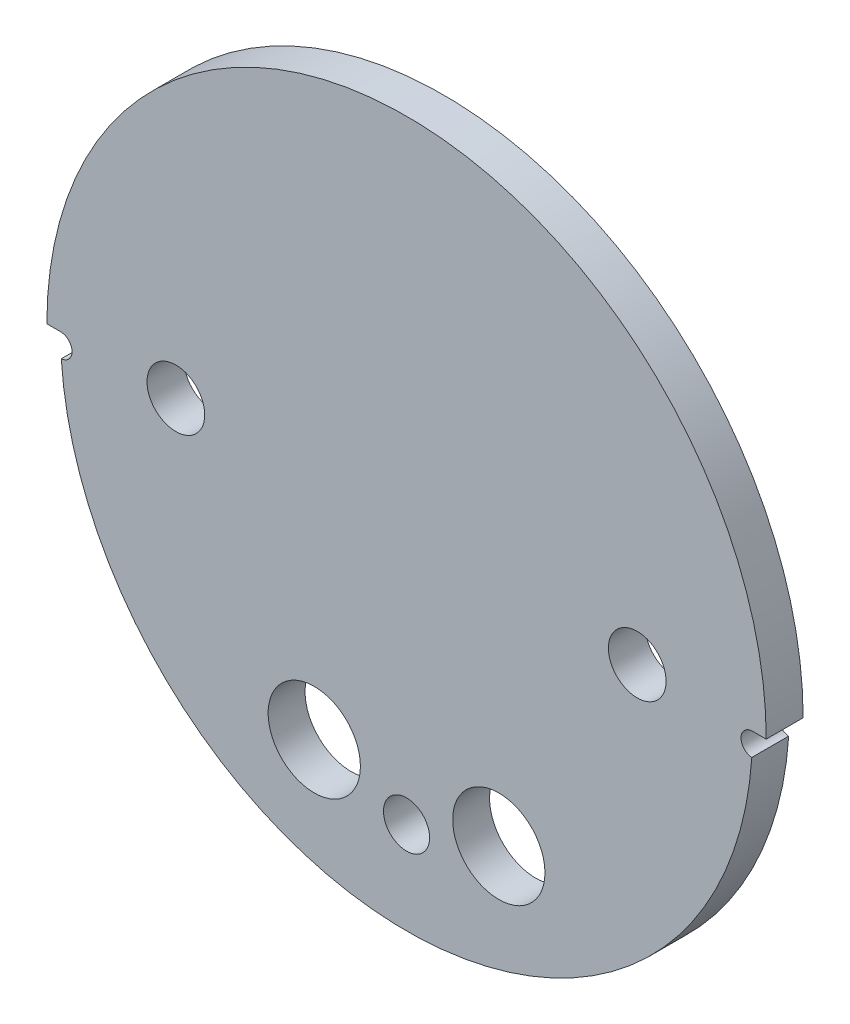
ISO-10303-21;
HEADER;
FILE_DESCRIPTION(('STEP AP214'),'2;1');
FILE_NAME('part.step','',(''),(''),'','','');
FILE_SCHEMA(('AUTOMOTIVE_DESIGN { 1 0 10303 214 1 1 1 1 }'));
ENDSEC;
DATA;
#1=APPLICATION_CONTEXT('core data for automotive mechanical design processes');
#2=APPLICATION_PROTOCOL_DEFINITION('international standard','automotive_design',2000,#1);
#3=PRODUCT_CONTEXT('',#1,'mechanical');
#4=PRODUCT('Part','Part','',(#3));
#5=PRODUCT_RELATED_PRODUCT_CATEGORY('part','',(#4));
#6=PRODUCT_DEFINITION_FORMATION('','',#4);
#7=PRODUCT_DEFINITION_CONTEXT('part definition',#1,'design');
#8=PRODUCT_DEFINITION('design','',#6,#7);
#9=PRODUCT_DEFINITION_SHAPE('','',#8);
#10=(LENGTH_UNIT() NAMED_UNIT(*) SI_UNIT(.MILLI.,.METRE.));
#11=(NAMED_UNIT(*) PLANE_ANGLE_UNIT() SI_UNIT($,.RADIAN.));
#12=(NAMED_UNIT(*) SI_UNIT($,.STERADIAN.) SOLID_ANGLE_UNIT());
#13=UNCERTAINTY_MEASURE_WITH_UNIT(LENGTH_MEASURE(1.E-05),#10,'distance_accuracy_value','');
#14=(GEOMETRIC_REPRESENTATION_CONTEXT(3) GLOBAL_UNCERTAINTY_ASSIGNED_CONTEXT((#13)) GLOBAL_UNIT_ASSIGNED_CONTEXT((#10,
#11,#12)) REPRESENTATION_CONTEXT('',''));
#15=CARTESIAN_POINT('',(0.,0.,0.));
#16=DIRECTION('',(0.,0.,1.));
#17=DIRECTION('',(1.,0.,0.));
#18=AXIS2_PLACEMENT_3D('',#15,#16,#17);
#19=CARTESIAN_POINT('',(0.,0.,8.255));
#20=DIRECTION('',(0.,0.,-1.));
#21=DIRECTION('',(-1.,0.,0.));
#22=AXIS2_PLACEMENT_3D('',#19,#20,#21);
#23=CYLINDRICAL_SURFACE('',#22,47.625);
#24=CARTESIAN_POINT('',(0.,0.,0.));
#25=DIRECTION('',(0.,0.,-1.));
#26=DIRECTION('',(1.,0.,0.));
#27=AXIS2_PLACEMENT_3D('',#24,#25,#26);
#28=CIRCLE('',#27,47.625);
#29=CARTESIAN_POINT('',(47.5192841287458,-3.17147613762486,0.));
#30=VERTEX_POINT('',#29);
#31=CARTESIAN_POINT('',(-47.5192841287458,-3.17147613762486,0.));
#32=VERTEX_POINT('',#31);
#33=EDGE_CURVE('E104',#30,#32,#28,.T.);
#34=ORIENTED_EDGE('',*,*,#33,.F.);
#35=DIRECTION('',(0.,0.,-1.));
#36=VECTOR('',#35,1.);
#37=CARTESIAN_POINT('',(47.5192841287458,-3.17147613762486,2.54));
#38=LINE('',#37,#36);
#39=CARTESIAN_POINT('',(47.5192841287458,-3.17147613762486,5.08));
#40=VERTEX_POINT('',#39);
#41=EDGE_CURVE('E145',#30,#40,#38,.F.);
#42=ORIENTED_EDGE('',*,*,#41,.T.);
#43=CARTESIAN_POINT('',(0.,0.,5.08));
#44=DIRECTION('',(0.,0.,1.));
#45=DIRECTION('',(1.,0.,0.));
#46=AXIS2_PLACEMENT_3D('',#43,#44,#45);
#47=CIRCLE('',#46,47.625);
#48=CARTESIAN_POINT('',(-47.5192841287458,-3.17147613762486,5.08));
#49=VERTEX_POINT('',#48);
#50=EDGE_CURVE('E148',#49,#40,#47,.T.);
#51=ORIENTED_EDGE('',*,*,#50,.F.);
#52=DIRECTION('',(0.,0.,-1.));
#53=VECTOR('',#52,1.);
#54=CARTESIAN_POINT('',(-47.5192841287458,-3.17147613762486,2.54));
#55=LINE('',#54,#53);
#56=EDGE_CURVE('E147',#49,#32,#55,.T.);
#57=ORIENTED_EDGE('',*,*,#56,.T.);
#58=EDGE_LOOP('',(#34,#42,#51,#57));
#59=FACE_BOUND('',#58,.T.);
#60=ADVANCED_FACE('F34',(#59),#23,.T.);
#61=CARTESIAN_POINT('',(31.75,0.,0.));
#62=DIRECTION('',(0.,0.,1.));
#63=DIRECTION('',(1.,0.,0.));
#64=AXIS2_PLACEMENT_3D('',#61,#62,#63);
#65=CYLINDRICAL_SURFACE('',#64,3.96875);
#66=CARTESIAN_POINT('',(31.75,0.,0.));
#67=DIRECTION('',(0.,0.,1.));
#68=DIRECTION('',(1.,0.,0.));
#69=AXIS2_PLACEMENT_3D('',#66,#67,#68);
#70=CIRCLE('',#69,3.96875);
#71=CARTESIAN_POINT('',(35.71875,0.,0.));
#72=VERTEX_POINT('',#71);
#73=EDGE_CURVE('E127',#72,#72,#70,.T.);
#74=ORIENTED_EDGE('',*,*,#73,.F.);
#75=EDGE_LOOP('',(#74));
#76=FACE_BOUND('',#75,.T.);
#77=CARTESIAN_POINT('',(31.75,0.,5.08));
#78=DIRECTION('',(0.,0.,1.));
#79=DIRECTION('',(1.,0.,0.));
#80=AXIS2_PLACEMENT_3D('',#77,#78,#79);
#81=CIRCLE('',#80,3.96875);
#82=CARTESIAN_POINT('',(35.71875,0.,5.08));
#83=VERTEX_POINT('',#82);
#84=EDGE_CURVE('E115',#83,#83,#81,.F.);
#85=ORIENTED_EDGE('',*,*,#84,.F.);
#86=EDGE_LOOP('',(#85));
#87=FACE_BOUND('',#86,.T.);
#88=ADVANCED_FACE('F169',(#76,#87),#65,.F.);
#89=CARTESIAN_POINT('',(-12.7,-31.1667936271924,0.));
#90=DIRECTION('',(0.,0.,1.));
#91=DIRECTION('',(1.,0.,0.));
#92=AXIS2_PLACEMENT_3D('',#89,#90,#91);
#93=CYLINDRICAL_SURFACE('',#92,6.35);
#94=CARTESIAN_POINT('',(-12.7,-31.1667936271924,0.));
#95=DIRECTION('',(0.,0.,1.));
#96=DIRECTION('',(1.,0.,0.));
#97=AXIS2_PLACEMENT_3D('',#94,#95,#96);
#98=CIRCLE('',#97,6.35);
#99=CARTESIAN_POINT('',(-6.34999999999999,-31.1667936271924,0.));
#100=VERTEX_POINT('',#99);
#101=EDGE_CURVE('E130',#100,#100,#98,.T.);
#102=ORIENTED_EDGE('',*,*,#101,.F.);
#103=EDGE_LOOP('',(#102));
#104=FACE_BOUND('',#103,.T.);
#105=CARTESIAN_POINT('',(-12.7,-31.1667936271924,5.08));
#106=DIRECTION('',(0.,0.,1.));
#107=DIRECTION('',(1.,0.,0.));
#108=AXIS2_PLACEMENT_3D('',#105,#106,#107);
#109=CIRCLE('',#108,6.35);
#110=CARTESIAN_POINT('',(-6.34999999999999,-31.1667936271924,5.08));
#111=VERTEX_POINT('',#110);
#112=EDGE_CURVE('E162',#111,#111,#109,.F.);
#113=ORIENTED_EDGE('',*,*,#112,.F.);
#114=EDGE_LOOP('',(#113));
#115=FACE_BOUND('',#114,.T.);
#116=ADVANCED_FACE('F171',(#104,#115),#93,.F.);
#117=CARTESIAN_POINT('',(12.7,-31.1667936271924,0.));
#118=DIRECTION('',(0.,0.,1.));
#119=DIRECTION('',(1.,0.,0.));
#120=AXIS2_PLACEMENT_3D('',#117,#118,#119);
#121=CYLINDRICAL_SURFACE('',#120,6.35);
#122=CARTESIAN_POINT('',(12.7,-31.1667936271924,0.));
#123=DIRECTION('',(0.,0.,1.));
#124=DIRECTION('',(1.,0.,0.));
#125=AXIS2_PLACEMENT_3D('',#122,#123,#124);
#126=CIRCLE('',#125,6.35);
#127=CARTESIAN_POINT('',(19.05,-31.1667936271924,0.));
#128=VERTEX_POINT('',#127);
#129=EDGE_CURVE('E122',#128,#128,#126,.T.);
#130=ORIENTED_EDGE('',*,*,#129,.F.);
#131=EDGE_LOOP('',(#130));
#132=FACE_BOUND('',#131,.T.);
#133=CARTESIAN_POINT('',(12.7,-31.1667936271924,5.08));
#134=DIRECTION('',(0.,0.,1.));
#135=DIRECTION('',(1.,0.,0.));
#136=AXIS2_PLACEMENT_3D('',#133,#134,#135);
#137=CIRCLE('',#136,6.35);
#138=CARTESIAN_POINT('',(19.05,-31.1667936271924,5.08));
#139=VERTEX_POINT('',#138);
#140=EDGE_CURVE('E159',#139,#139,#137,.F.);
#141=ORIENTED_EDGE('',*,*,#140,.F.);
#142=EDGE_LOOP('',(#141));
#143=FACE_BOUND('',#142,.T.);
#144=ADVANCED_FACE('F178',(#132,#143),#121,.F.);
#145=CARTESIAN_POINT('',(-31.75,0.,0.));
#146=DIRECTION('',(0.,0.,1.));
#147=DIRECTION('',(1.,0.,0.));
#148=AXIS2_PLACEMENT_3D('',#145,#146,#147);
#149=CYLINDRICAL_SURFACE('',#148,3.96875);
#150=CARTESIAN_POINT('',(-31.75,0.,0.));
#151=DIRECTION('',(0.,0.,1.));
#152=DIRECTION('',(1.,0.,0.));
#153=AXIS2_PLACEMENT_3D('',#150,#151,#152);
#154=CIRCLE('',#153,3.96875);
#155=CARTESIAN_POINT('',(-27.78125,0.,0.));
#156=VERTEX_POINT('',#155);
#157=EDGE_CURVE('E123',#156,#156,#154,.T.);
#158=ORIENTED_EDGE('',*,*,#157,.F.);
#159=EDGE_LOOP('',(#158));
#160=FACE_BOUND('',#159,.T.);
#161=CARTESIAN_POINT('',(-31.75,0.,5.08));
#162=DIRECTION('',(0.,0.,1.));
#163=DIRECTION('',(1.,0.,0.));
#164=AXIS2_PLACEMENT_3D('',#161,#162,#163);
#165=CIRCLE('',#164,3.96875);
#166=CARTESIAN_POINT('',(-27.78125,0.,5.08));
#167=VERTEX_POINT('',#166);
#168=EDGE_CURVE('E156',#167,#167,#165,.F.);
#169=ORIENTED_EDGE('',*,*,#168,.F.);
#170=EDGE_LOOP('',(#169));
#171=FACE_BOUND('',#170,.T.);
#172=ADVANCED_FACE('F210',(#160,#171),#149,.F.);
#173=CARTESIAN_POINT('',(0.,0.,5.08));
#174=DIRECTION('',(0.,0.,-1.));
#175=DIRECTION('',(-1.,0.,0.));
#176=AXIS2_PLACEMENT_3D('',#173,#174,#175);
#177=CYLINDRICAL_SURFACE('',#176,49.5046);
#178=CARTESIAN_POINT('',(0.,0.,5.08));
#179=DIRECTION('',(0.,0.,1.));
#180=DIRECTION('',(1.,0.,0.));
#181=AXIS2_PLACEMENT_3D('',#178,#179,#180);
#182=CIRCLE('',#181,49.5046);
#183=CARTESIAN_POINT('',(49.5046,0.,5.08));
#184=VERTEX_POINT('',#183);
#185=CARTESIAN_POINT('',(-49.5046,0.,5.08));
#186=VERTEX_POINT('',#185);
#187=EDGE_CURVE('E42',#184,#186,#182,.T.);
#188=ORIENTED_EDGE('',*,*,#187,.F.);
#189=DIRECTION('',(0.,0.,-1.));
#190=VECTOR('',#189,1.);
#191=CARTESIAN_POINT('',(49.5046,0.,5.08));
#192=LINE('',#191,#190);
#193=CARTESIAN_POINT('',(49.5046,0.,0.));
#194=VERTEX_POINT('',#193);
#195=EDGE_CURVE('E120',#184,#194,#192,.T.);
#196=ORIENTED_EDGE('',*,*,#195,.T.);
#197=CARTESIAN_POINT('',(0.,0.,0.));
#198=DIRECTION('',(0.,0.,1.));
#199=DIRECTION('',(1.,0.,0.));
#200=AXIS2_PLACEMENT_3D('',#197,#198,#199);
#201=CIRCLE('',#200,49.5046);
#202=CARTESIAN_POINT('',(-49.5046,0.,0.));
#203=VERTEX_POINT('',#202);
#204=EDGE_CURVE('E126',#194,#203,#201,.T.);
#205=ORIENTED_EDGE('',*,*,#204,.T.);
#206=DIRECTION('',(0.,0.,-1.));
#207=VECTOR('',#206,1.);
#208=CARTESIAN_POINT('',(-49.5046,0.,5.08));
#209=LINE('',#208,#207);
#210=EDGE_CURVE('E55',#203,#186,#209,.F.);
#211=ORIENTED_EDGE('',*,*,#210,.T.);
#212=EDGE_LOOP('',(#188,#196,#205,#211));
#213=FACE_BOUND('',#212,.T.);
#214=ADVANCED_FACE('F36',(#213),#177,.T.);
#215=CARTESIAN_POINT('',(0.,0.,5.08));
#216=DIRECTION('',(0.,0.,1.));
#217=DIRECTION('',(1.,0.,0.));
#218=AXIS2_PLACEMENT_3D('',#215,#216,#217);
#219=PLANE('',#218);
#220=CARTESIAN_POINT('',(0.,-34.925,5.08));
#221=DIRECTION('',(0.,0.,1.));
#222=DIRECTION('',(1.,0.,0.));
#223=AXIS2_PLACEMENT_3D('',#220,#221,#222);
#224=CIRCLE('',#223,3.175);
#225=CARTESIAN_POINT('',(3.175,-34.925,5.08));
#226=VERTEX_POINT('',#225);
#227=EDGE_CURVE('E237',#226,#226,#224,.T.);
#228=ORIENTED_EDGE('',*,*,#227,.F.);
#229=EDGE_LOOP('',(#228));
#230=FACE_BOUND('',#229,.T.);
#231=CARTESIAN_POINT('',(47.625,-1.5875,5.08));
#232=DIRECTION('',(0.,0.,-1.));
#233=DIRECTION('',(-1.,0.,0.));
#234=AXIS2_PLACEMENT_3D('',#231,#232,#233);
#235=CIRCLE('',#234,1.5875);
#236=CARTESIAN_POINT('',(47.625,0.,5.08));
#237=VERTEX_POINT('',#236);
#238=EDGE_CURVE('E140',#40,#237,#235,.T.);
#239=ORIENTED_EDGE('',*,*,#238,.T.);
#240=DIRECTION('',(-1.,0.,0.));
#241=VECTOR('',#240,1.);
#242=CARTESIAN_POINT('',(47.625,0.,5.08));
#243=LINE('',#242,#241);
#244=EDGE_CURVE('E109',#184,#237,#243,.T.);
#245=ORIENTED_EDGE('',*,*,#244,.F.);
#246=ORIENTED_EDGE('',*,*,#187,.T.);
#247=DIRECTION('',(-1.,0.,0.));
#248=VECTOR('',#247,1.);
#249=CARTESIAN_POINT('',(-50.165,0.,5.08));
#250=LINE('',#249,#248);
#251=CARTESIAN_POINT('',(-47.625,0.,5.08));
#252=VERTEX_POINT('',#251);
#253=EDGE_CURVE('E113',#252,#186,#250,.T.);
#254=ORIENTED_EDGE('',*,*,#253,.F.);
#255=CARTESIAN_POINT('',(-47.625,-1.5875,5.08));
#256=DIRECTION('',(0.,0.,-1.));
#257=DIRECTION('',(-1.,0.,0.));
#258=AXIS2_PLACEMENT_3D('',#255,#256,#257);
#259=CIRCLE('',#258,1.5875);
#260=EDGE_CURVE('E92',#252,#49,#259,.T.);
#261=ORIENTED_EDGE('',*,*,#260,.T.);
#262=ORIENTED_EDGE('',*,*,#50,.T.);
#263=EDGE_LOOP('',(#239,#245,#246,#254,#261,#262));
#264=FACE_BOUND('',#263,.T.);
#265=ORIENTED_EDGE('',*,*,#168,.T.);
#266=EDGE_LOOP('',(#265));
#267=FACE_BOUND('',#266,.T.);
#268=ORIENTED_EDGE('',*,*,#140,.T.);
#269=EDGE_LOOP('',(#268));
#270=FACE_BOUND('',#269,.T.);
#271=ORIENTED_EDGE('',*,*,#112,.T.);
#272=EDGE_LOOP('',(#271));
#273=FACE_BOUND('',#272,.T.);
#274=ORIENTED_EDGE('',*,*,#84,.T.);
#275=EDGE_LOOP('',(#274));
#276=FACE_BOUND('',#275,.T.);
#277=ADVANCED_FACE('F167',(#230,#264,#267,#270,#273,#276),#219,.T.);
#278=CARTESIAN_POINT('',(0.,0.,0.));
#279=DIRECTION('',(0.,0.,1.));
#280=DIRECTION('',(1.,0.,0.));
#281=AXIS2_PLACEMENT_3D('',#278,#279,#280);
#282=PLANE('',#281);
#283=CARTESIAN_POINT('',(0.,-34.925,0.));
#284=DIRECTION('',(0.,0.,1.));
#285=DIRECTION('',(1.,0.,0.));
#286=AXIS2_PLACEMENT_3D('',#283,#284,#285);
#287=CIRCLE('',#286,3.175);
#288=CARTESIAN_POINT('',(3.175,-34.925,0.));
#289=VERTEX_POINT('',#288);
#290=EDGE_CURVE('E105',#289,#289,#287,.T.);
#291=ORIENTED_EDGE('',*,*,#290,.T.);
#292=EDGE_LOOP('',(#291));
#293=FACE_BOUND('',#292,.T.);
#294=ORIENTED_EDGE('',*,*,#157,.T.);
#295=EDGE_LOOP('',(#294));
#296=FACE_BOUND('',#295,.T.);
#297=ORIENTED_EDGE('',*,*,#129,.T.);
#298=EDGE_LOOP('',(#297));
#299=FACE_BOUND('',#298,.T.);
#300=ORIENTED_EDGE('',*,*,#101,.T.);
#301=EDGE_LOOP('',(#300));
#302=FACE_BOUND('',#301,.T.);
#303=ORIENTED_EDGE('',*,*,#73,.T.);
#304=EDGE_LOOP('',(#303));
#305=FACE_BOUND('',#304,.T.);
#306=DIRECTION('',(-1.,0.,0.));
#307=VECTOR('',#306,1.);
#308=CARTESIAN_POINT('',(0.,0.,0.));
#309=LINE('',#308,#307);
#310=CARTESIAN_POINT('',(47.625,0.,0.));
#311=VERTEX_POINT('',#310);
#312=EDGE_CURVE('E11',#194,#311,#309,.T.);
#313=ORIENTED_EDGE('',*,*,#312,.T.);
#314=CARTESIAN_POINT('',(47.625,-1.5875,0.));
#315=DIRECTION('',(0.,0.,-1.));
#316=DIRECTION('',(-1.,0.,0.));
#317=AXIS2_PLACEMENT_3D('',#314,#315,#316);
#318=CIRCLE('',#317,1.5875);
#319=EDGE_CURVE('E138',#30,#311,#318,.T.);
#320=ORIENTED_EDGE('',*,*,#319,.F.);
#321=ORIENTED_EDGE('',*,*,#33,.T.);
#322=CARTESIAN_POINT('',(-47.625,-1.5875,0.));
#323=DIRECTION('',(0.,0.,-1.));
#324=DIRECTION('',(-1.,0.,0.));
#325=AXIS2_PLACEMENT_3D('',#322,#323,#324);
#326=CIRCLE('',#325,1.5875);
#327=CARTESIAN_POINT('',(-47.625,0.,0.));
#328=VERTEX_POINT('',#327);
#329=EDGE_CURVE('E89',#328,#32,#326,.T.);
#330=ORIENTED_EDGE('',*,*,#329,.F.);
#331=DIRECTION('',(-1.,0.,0.));
#332=VECTOR('',#331,1.);
#333=CARTESIAN_POINT('',(-50.165,0.,0.));
#334=LINE('',#333,#332);
#335=EDGE_CURVE('E95',#328,#203,#334,.T.);
#336=ORIENTED_EDGE('',*,*,#335,.T.);
#337=ORIENTED_EDGE('',*,*,#204,.F.);
#338=EDGE_LOOP('',(#313,#320,#321,#330,#336,#337));
#339=FACE_BOUND('',#338,.T.);
#340=ADVANCED_FACE('F99',(#293,#296,#299,#302,#305,#339),#282,.F.);
#341=CARTESIAN_POINT('',(47.625,0.,0.));
#342=DIRECTION('',(0.,1.,0.));
#343=DIRECTION('',(0.,0.,1.));
#344=AXIS2_PLACEMENT_3D('',#341,#342,#343);
#345=PLANE('',#344);
#346=ORIENTED_EDGE('',*,*,#244,.T.);
#347=DIRECTION('',(0.,0.,1.));
#348=VECTOR('',#347,1.);
#349=CARTESIAN_POINT('',(47.625,0.,0.));
#350=LINE('',#349,#348);
#351=EDGE_CURVE('E94',#311,#237,#350,.T.);
#352=ORIENTED_EDGE('',*,*,#351,.F.);
#353=ORIENTED_EDGE('',*,*,#312,.F.);
#354=ORIENTED_EDGE('',*,*,#195,.F.);
#355=EDGE_LOOP('',(#346,#352,#353,#354));
#356=FACE_BOUND('',#355,.T.);
#357=ADVANCED_FACE('F189',(#356),#345,.F.);
#358=CARTESIAN_POINT('',(-50.165,0.,0.));
#359=DIRECTION('',(0.,1.,0.));
#360=DIRECTION('',(0.,0.,1.));
#361=AXIS2_PLACEMENT_3D('',#358,#359,#360);
#362=PLANE('',#361);
#363=ORIENTED_EDGE('',*,*,#335,.F.);
#364=DIRECTION('',(0.,0.,1.));
#365=VECTOR('',#364,1.);
#366=CARTESIAN_POINT('',(-47.625,0.,0.));
#367=LINE('',#366,#365);
#368=EDGE_CURVE('E86',#328,#252,#367,.T.);
#369=ORIENTED_EDGE('',*,*,#368,.T.);
#370=ORIENTED_EDGE('',*,*,#253,.T.);
#371=ORIENTED_EDGE('',*,*,#210,.F.);
#372=EDGE_LOOP('',(#363,#369,#370,#371));
#373=FACE_BOUND('',#372,.T.);
#374=ADVANCED_FACE('F107',(#373),#362,.F.);
#375=CARTESIAN_POINT('',(-47.625,-1.5875,5.08));
#376=DIRECTION('',(0.,0.,-1.));
#377=DIRECTION('',(-1.,0.,0.));
#378=AXIS2_PLACEMENT_3D('',#375,#376,#377);
#379=CYLINDRICAL_SURFACE('',#378,1.5875);
#380=ORIENTED_EDGE('',*,*,#260,.F.);
#381=ORIENTED_EDGE('',*,*,#368,.F.);
#382=ORIENTED_EDGE('',*,*,#329,.T.);
#383=ORIENTED_EDGE('',*,*,#56,.F.);
#384=EDGE_LOOP('',(#380,#381,#382,#383));
#385=FACE_BOUND('',#384,.T.);
#386=ADVANCED_FACE('F88',(#385),#379,.F.);
#387=CARTESIAN_POINT('',(47.625,-1.5875,5.08));
#388=DIRECTION('',(0.,0.,-1.));
#389=DIRECTION('',(-1.,0.,0.));
#390=AXIS2_PLACEMENT_3D('',#387,#388,#389);
#391=CYLINDRICAL_SURFACE('',#390,1.5875);
#392=ORIENTED_EDGE('',*,*,#319,.T.);
#393=ORIENTED_EDGE('',*,*,#351,.T.);
#394=ORIENTED_EDGE('',*,*,#238,.F.);
#395=ORIENTED_EDGE('',*,*,#41,.F.);
#396=EDGE_LOOP('',(#392,#393,#394,#395));
#397=FACE_BOUND('',#396,.T.);
#398=ADVANCED_FACE('F226',(#397),#391,.F.);
#399=CARTESIAN_POINT('',(0.,-34.925,0.));
#400=DIRECTION('',(0.,0.,1.));
#401=DIRECTION('',(1.,0.,0.));
#402=AXIS2_PLACEMENT_3D('',#399,#400,#401);
#403=CYLINDRICAL_SURFACE('',#402,3.175);
#404=ORIENTED_EDGE('',*,*,#290,.F.);
#405=EDGE_LOOP('',(#404));
#406=FACE_BOUND('',#405,.T.);
#407=ORIENTED_EDGE('',*,*,#227,.T.);
#408=EDGE_LOOP('',(#407));
#409=FACE_BOUND('',#408,.T.);
#410=ADVANCED_FACE('F229',(#406,#409),#403,.F.);
#411=CLOSED_SHELL('',(#60,#88,#116,#144,#172,#214,#277,#340,#357,#374,#386,#398,#410));
#412=MANIFOLD_SOLID_BREP('B2',#411);
#413=ADVANCED_BREP_SHAPE_REPRESENTATION('',(#18,#412),#14);
#414=SHAPE_DEFINITION_REPRESENTATION(#9,#413);
ENDSEC;
END-ISO-10303-21;
